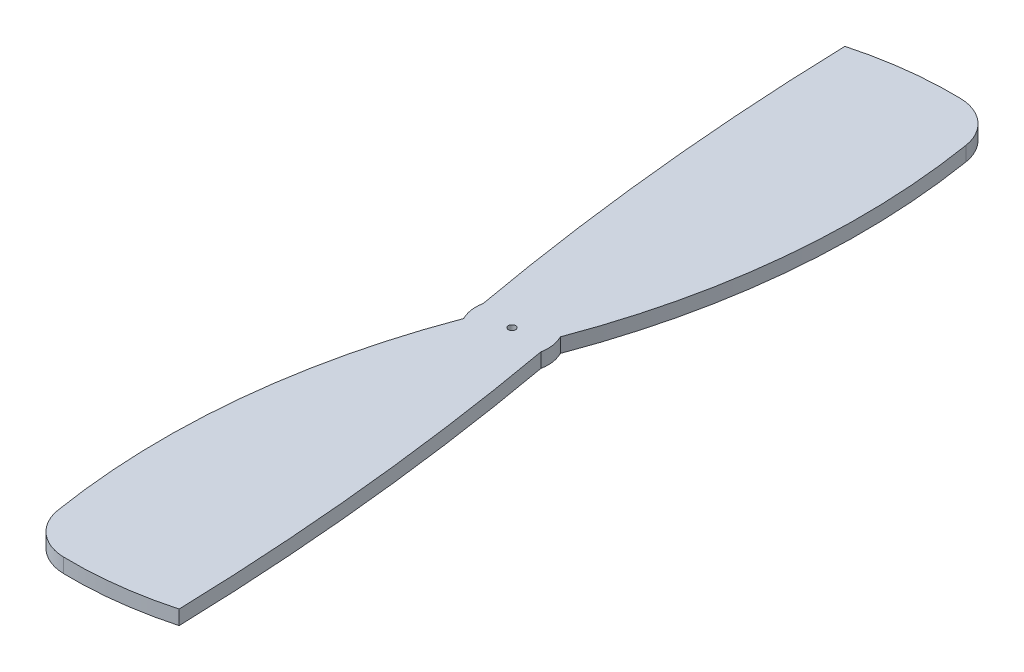
ISO-10303-21;
HEADER;
FILE_DESCRIPTION(('STEP AP214'),'2;1');
FILE_NAME('part.step','',(''),(''),'','','');
FILE_SCHEMA(('AUTOMOTIVE_DESIGN { 1 0 10303 214 1 1 1 1 }'));
ENDSEC;
DATA;
#1=APPLICATION_CONTEXT('core data for automotive mechanical design processes');
#2=APPLICATION_PROTOCOL_DEFINITION('international standard','automotive_design',2000,#1);
#3=PRODUCT_CONTEXT('',#1,'mechanical');
#4=PRODUCT('Part','Part','',(#3));
#5=PRODUCT_RELATED_PRODUCT_CATEGORY('part','',(#4));
#6=PRODUCT_DEFINITION_FORMATION('','',#4);
#7=PRODUCT_DEFINITION_CONTEXT('part definition',#1,'design');
#8=PRODUCT_DEFINITION('design','',#6,#7);
#9=PRODUCT_DEFINITION_SHAPE('','',#8);
#10=(LENGTH_UNIT() NAMED_UNIT(*) SI_UNIT(.MILLI.,.METRE.));
#11=(NAMED_UNIT(*) PLANE_ANGLE_UNIT() SI_UNIT($,.RADIAN.));
#12=(NAMED_UNIT(*) SI_UNIT($,.STERADIAN.) SOLID_ANGLE_UNIT());
#13=UNCERTAINTY_MEASURE_WITH_UNIT(LENGTH_MEASURE(1.E-05),#10,'distance_accuracy_value','');
#14=(GEOMETRIC_REPRESENTATION_CONTEXT(3) GLOBAL_UNCERTAINTY_ASSIGNED_CONTEXT((#13)) GLOBAL_UNIT_ASSIGNED_CONTEXT((#10,
#11,#12)) REPRESENTATION_CONTEXT('',''));
#15=CARTESIAN_POINT('',(0.,0.,0.));
#16=DIRECTION('',(0.,0.,1.));
#17=DIRECTION('',(1.,0.,0.));
#18=AXIS2_PLACEMENT_3D('',#15,#16,#17);
#19=CARTESIAN_POINT('',(-3.16624329817526,0.8,-35.7480702714676));
#20=DIRECTION('',(0.,1.,0.));
#21=DIRECTION('',(0.,0.,1.));
#22=AXIS2_PLACEMENT_3D('',#19,#20,#21);
#23=PLANE('',#22);
#24=CARTESIAN_POINT('',(-2.98248659635051,0.8,-44.4961405429351));
#25=DIRECTION('',(0.,1.,0.));
#26=DIRECTION('',(0.,0.,1.));
#27=AXIS2_PLACEMENT_3D('',#24,#25,#26);
#28=CIRCLE('',#27,2.50000000000001);
#29=CARTESIAN_POINT('',(-0.514652369440545,0.8,-44.8958832457975));
#30=VERTEX_POINT('',#29);
#31=CARTESIAN_POINT('',(-2.92998468154344,0.8,-46.9955891919259));
#32=VERTEX_POINT('',#31);
#33=EDGE_CURVE('E161',#30,#32,#28,.T.);
#34=ORIENTED_EDGE('',*,*,#33,.T.);
#35=CARTESIAN_POINT('',(-3.35,0.8,-27.));
#36=DIRECTION('',(0.,1.,0.));
#37=DIRECTION('',(0.,0.,1.));
#38=AXIS2_PLACEMENT_3D('',#35,#36,#37);
#39=CIRCLE('',#38,20.);
#40=CARTESIAN_POINT('',(-8.64083736312973,0.8,-46.2874840245407));
#41=VERTEX_POINT('',#40);
#42=EDGE_CURVE('E99',#32,#41,#39,.T.);
#43=ORIENTED_EDGE('',*,*,#42,.T.);
#44=CARTESIAN_POINT('',(141.3,0.8,-50.5));
#45=DIRECTION('',(0.,1.,0.));
#46=DIRECTION('',(0.,0.,1.));
#47=AXIS2_PLACEMENT_3D('',#44,#45,#46);
#48=CIRCLE('',#47,150.);
#49=CARTESIAN_POINT('',(-6.31636321069811,0.8,-23.865261171784));
#50=VERTEX_POINT('',#49);
#51=EDGE_CURVE('E182',#41,#50,#48,.T.);
#52=ORIENTED_EDGE('',*,*,#51,.T.);
#53=CARTESIAN_POINT('',(-4.35,0.8,-23.5));
#54=DIRECTION('',(0.,1.,0.));
#55=DIRECTION('',(0.,0.,1.));
#56=AXIS2_PLACEMENT_3D('',#53,#54,#55);
#57=CIRCLE('',#56,2.);
#58=CARTESIAN_POINT('',(-6.13400324761186,0.8,-22.5959356148425));
#59=VERTEX_POINT('',#58);
#60=EDGE_CURVE('E201',#50,#59,#57,.T.);
#61=ORIENTED_EDGE('',*,*,#60,.T.);
#62=CARTESIAN_POINT('',(31.3,0.8,-8.5));
#63=DIRECTION('',(0.,1.,0.));
#64=DIRECTION('',(0.,0.,1.));
#65=AXIS2_PLACEMENT_3D('',#62,#63,#64);
#66=CIRCLE('',#65,40.);
#67=CARTESIAN_POINT('',(-8.18534763055946,0.8,-2.10411675420255));
#68=VERTEX_POINT('',#67);
#69=EDGE_CURVE('E198',#59,#68,#66,.T.);
#70=ORIENTED_EDGE('',*,*,#69,.T.);
#71=CARTESIAN_POINT('',(-5.71751340364949,0.8,-2.50385945706489));
#72=DIRECTION('',(0.,1.,0.));
#73=DIRECTION('',(0.,0.,1.));
#74=AXIS2_PLACEMENT_3D('',#71,#72,#73);
#75=CIRCLE('',#74,2.50000000000001);
#76=CARTESIAN_POINT('',(-5.77001531845657,0.8,-0.00441080807413868));
#77=VERTEX_POINT('',#76);
#78=EDGE_CURVE('E200',#68,#77,#75,.T.);
#79=ORIENTED_EDGE('',*,*,#78,.T.);
#80=CARTESIAN_POINT('',(-5.35,0.8,-20.));
#81=DIRECTION('',(0.,1.,0.));
#82=DIRECTION('',(0.,0.,1.));
#83=AXIS2_PLACEMENT_3D('',#80,#81,#82);
#84=CIRCLE('',#83,20.);
#85=CARTESIAN_POINT('',(-0.0591626368702525,0.8,-0.712515975459353));
#86=VERTEX_POINT('',#85);
#87=EDGE_CURVE('E124',#77,#86,#84,.T.);
#88=ORIENTED_EDGE('',*,*,#87,.T.);
#89=CARTESIAN_POINT('',(-150.,0.8,3.5));
#90=DIRECTION('',(0.,1.,0.));
#91=DIRECTION('',(0.,0.,1.));
#92=AXIS2_PLACEMENT_3D('',#89,#90,#91);
#93=CIRCLE('',#92,150.);
#94=CARTESIAN_POINT('',(-2.38363678930189,0.8,-23.134738828216));
#95=VERTEX_POINT('',#94);
#96=EDGE_CURVE('E118',#86,#95,#93,.T.);
#97=ORIENTED_EDGE('',*,*,#96,.T.);
#98=CARTESIAN_POINT('',(-4.35,0.8,-23.5));
#99=DIRECTION('',(0.,1.,0.));
#100=DIRECTION('',(0.,0.,1.));
#101=AXIS2_PLACEMENT_3D('',#98,#99,#100);
#102=CIRCLE('',#101,2.);
#103=CARTESIAN_POINT('',(-2.56599675238813,0.8,-24.4040643851576));
#104=VERTEX_POINT('',#103);
#105=EDGE_CURVE('E122',#95,#104,#102,.T.);
#106=ORIENTED_EDGE('',*,*,#105,.T.);
#107=CARTESIAN_POINT('',(-40.,0.8,-38.5));
#108=DIRECTION('',(0.,1.,0.));
#109=DIRECTION('',(0.,0.,1.));
#110=AXIS2_PLACEMENT_3D('',#107,#108,#109);
#111=CIRCLE('',#110,40.);
#112=EDGE_CURVE('E50',#104,#30,#111,.T.);
#113=ORIENTED_EDGE('',*,*,#112,.T.);
#114=EDGE_LOOP('',(#34,#43,#52,#61,#70,#79,#88,#97,#106,#113));
#115=FACE_BOUND('',#114,.T.);
#116=CARTESIAN_POINT('',(-4.35,0.8,-23.5));
#117=DIRECTION('',(0.,1.,0.));
#118=DIRECTION('',(0.,0.,1.));
#119=AXIS2_PLACEMENT_3D('',#116,#117,#118);
#120=CIRCLE('',#119,0.199999999999999);
#121=CARTESIAN_POINT('',(-4.35,0.8,-23.3));
#122=VERTEX_POINT('',#121);
#123=EDGE_CURVE('E146',#122,#122,#120,.T.);
#124=ORIENTED_EDGE('',*,*,#123,.F.);
#125=EDGE_LOOP('',(#124));
#126=FACE_BOUND('',#125,.T.);
#127=ADVANCED_FACE('F33',(#115,#126),#23,.T.);
#128=CARTESIAN_POINT('',(-3.16624329817526,0.,-35.7480702714676));
#129=DIRECTION('',(0.,1.,0.));
#130=DIRECTION('',(0.,0.,1.));
#131=AXIS2_PLACEMENT_3D('',#128,#129,#130);
#132=PLANE('',#131);
#133=CARTESIAN_POINT('',(-2.98248659635051,0.,-44.4961405429351));
#134=DIRECTION('',(0.,1.,0.));
#135=DIRECTION('',(0.,0.,1.));
#136=AXIS2_PLACEMENT_3D('',#133,#134,#135);
#137=CIRCLE('',#136,2.50000000000001);
#138=CARTESIAN_POINT('',(-0.514652369440545,0.,-44.8958832457975));
#139=VERTEX_POINT('',#138);
#140=CARTESIAN_POINT('',(-2.92998468154344,0.,-46.9955891919259));
#141=VERTEX_POINT('',#140);
#142=EDGE_CURVE('E142',#139,#141,#137,.T.);
#143=ORIENTED_EDGE('',*,*,#142,.F.);
#144=CARTESIAN_POINT('',(-40.,0.,-38.5));
#145=DIRECTION('',(0.,1.,0.));
#146=DIRECTION('',(0.,0.,1.));
#147=AXIS2_PLACEMENT_3D('',#144,#145,#146);
#148=CIRCLE('',#147,40.);
#149=CARTESIAN_POINT('',(-2.56599675238813,0.,-24.4040643851576));
#150=VERTEX_POINT('',#149);
#151=EDGE_CURVE('E91',#150,#139,#148,.T.);
#152=ORIENTED_EDGE('',*,*,#151,.F.);
#153=CARTESIAN_POINT('',(-4.35,0.,-23.5));
#154=DIRECTION('',(0.,1.,0.));
#155=DIRECTION('',(0.,0.,1.));
#156=AXIS2_PLACEMENT_3D('',#153,#154,#155);
#157=CIRCLE('',#156,2.);
#158=CARTESIAN_POINT('',(-2.38363678930189,0.,-23.134738828216));
#159=VERTEX_POINT('',#158);
#160=EDGE_CURVE('E85',#159,#150,#157,.T.);
#161=ORIENTED_EDGE('',*,*,#160,.F.);
#162=CARTESIAN_POINT('',(-150.,0.,3.5));
#163=DIRECTION('',(0.,1.,0.));
#164=DIRECTION('',(0.,0.,1.));
#165=AXIS2_PLACEMENT_3D('',#162,#163,#164);
#166=CIRCLE('',#165,150.);
#167=CARTESIAN_POINT('',(-0.0591626368702525,0.,-0.712515975459353));
#168=VERTEX_POINT('',#167);
#169=EDGE_CURVE('E132',#168,#159,#166,.T.);
#170=ORIENTED_EDGE('',*,*,#169,.F.);
#171=CARTESIAN_POINT('',(-5.35,0.,-20.));
#172=DIRECTION('',(0.,1.,0.));
#173=DIRECTION('',(0.,0.,1.));
#174=AXIS2_PLACEMENT_3D('',#171,#172,#173);
#175=CIRCLE('',#174,20.);
#176=CARTESIAN_POINT('',(-5.77001531845657,0.,-0.00441080807413868));
#177=VERTEX_POINT('',#176);
#178=EDGE_CURVE('E156',#177,#168,#175,.T.);
#179=ORIENTED_EDGE('',*,*,#178,.F.);
#180=CARTESIAN_POINT('',(-5.71751340364949,0.,-2.50385945706489));
#181=DIRECTION('',(0.,1.,0.));
#182=DIRECTION('',(0.,0.,1.));
#183=AXIS2_PLACEMENT_3D('',#180,#181,#182);
#184=CIRCLE('',#183,2.50000000000001);
#185=CARTESIAN_POINT('',(-8.18534763055946,0.,-2.10411675420255));
#186=VERTEX_POINT('',#185);
#187=EDGE_CURVE('E154',#186,#177,#184,.T.);
#188=ORIENTED_EDGE('',*,*,#187,.F.);
#189=CARTESIAN_POINT('',(31.3,0.,-8.5));
#190=DIRECTION('',(0.,1.,0.));
#191=DIRECTION('',(0.,0.,1.));
#192=AXIS2_PLACEMENT_3D('',#189,#190,#191);
#193=CIRCLE('',#192,40.);
#194=CARTESIAN_POINT('',(-6.13400324761186,0.,-22.5959356148425));
#195=VERTEX_POINT('',#194);
#196=EDGE_CURVE('E152',#195,#186,#193,.T.);
#197=ORIENTED_EDGE('',*,*,#196,.F.);
#198=CARTESIAN_POINT('',(-4.35,0.,-23.5));
#199=DIRECTION('',(0.,1.,0.));
#200=DIRECTION('',(0.,0.,1.));
#201=AXIS2_PLACEMENT_3D('',#198,#199,#200);
#202=CIRCLE('',#201,2.);
#203=CARTESIAN_POINT('',(-6.31636321069811,0.,-23.865261171784));
#204=VERTEX_POINT('',#203);
#205=EDGE_CURVE('E150',#204,#195,#202,.T.);
#206=ORIENTED_EDGE('',*,*,#205,.F.);
#207=CARTESIAN_POINT('',(141.3,0.,-50.5));
#208=DIRECTION('',(0.,1.,0.));
#209=DIRECTION('',(0.,0.,1.));
#210=AXIS2_PLACEMENT_3D('',#207,#208,#209);
#211=CIRCLE('',#210,150.);
#212=CARTESIAN_POINT('',(-8.64083736312973,0.,-46.2874840245407));
#213=VERTEX_POINT('',#212);
#214=EDGE_CURVE('E148',#213,#204,#211,.T.);
#215=ORIENTED_EDGE('',*,*,#214,.F.);
#216=CARTESIAN_POINT('',(-3.35,0.,-27.));
#217=DIRECTION('',(0.,1.,0.));
#218=DIRECTION('',(0.,0.,1.));
#219=AXIS2_PLACEMENT_3D('',#216,#217,#218);
#220=CIRCLE('',#219,20.);
#221=EDGE_CURVE('E145',#141,#213,#220,.T.);
#222=ORIENTED_EDGE('',*,*,#221,.F.);
#223=EDGE_LOOP('',(#143,#152,#161,#170,#179,#188,#197,#206,#215,#222));
#224=FACE_BOUND('',#223,.T.);
#225=CARTESIAN_POINT('',(-4.35,0.,-23.5));
#226=DIRECTION('',(0.,1.,0.));
#227=DIRECTION('',(0.,0.,1.));
#228=AXIS2_PLACEMENT_3D('',#225,#226,#227);
#229=CIRCLE('',#228,0.199999999999999);
#230=CARTESIAN_POINT('',(-4.35,0.,-23.3));
#231=VERTEX_POINT('',#230);
#232=EDGE_CURVE('E209',#231,#231,#229,.T.);
#233=ORIENTED_EDGE('',*,*,#232,.T.);
#234=EDGE_LOOP('',(#233));
#235=FACE_BOUND('',#234,.T.);
#236=ADVANCED_FACE('F186',(#224,#235),#132,.F.);
#237=CARTESIAN_POINT('',(-2.98248659635051,0.8,-44.4961405429351));
#238=DIRECTION('',(0.,-1.,0.));
#239=DIRECTION('',(0.,0.,-1.));
#240=AXIS2_PLACEMENT_3D('',#237,#238,#239);
#241=CYLINDRICAL_SURFACE('',#240,2.50000000000001);
#242=ORIENTED_EDGE('',*,*,#142,.T.);
#243=DIRECTION('',(0.,-1.,0.));
#244=VECTOR('',#243,1.);
#245=CARTESIAN_POINT('',(-2.92998468154344,0.8,-46.9955891919259));
#246=LINE('',#245,#244);
#247=EDGE_CURVE('E11',#32,#141,#246,.T.);
#248=ORIENTED_EDGE('',*,*,#247,.F.);
#249=ORIENTED_EDGE('',*,*,#33,.F.);
#250=DIRECTION('',(0.,-1.,0.));
#251=VECTOR('',#250,1.);
#252=CARTESIAN_POINT('',(-0.514652369440545,0.8,-44.8958832457975));
#253=LINE('',#252,#251);
#254=EDGE_CURVE('E138',#30,#139,#253,.T.);
#255=ORIENTED_EDGE('',*,*,#254,.T.);
#256=EDGE_LOOP('',(#242,#248,#249,#255));
#257=FACE_BOUND('',#256,.T.);
#258=ADVANCED_FACE('F35',(#257),#241,.T.);
#259=CARTESIAN_POINT('',(-3.35,0.8,-27.));
#260=DIRECTION('',(0.,-1.,0.));
#261=DIRECTION('',(0.,0.,-1.));
#262=AXIS2_PLACEMENT_3D('',#259,#260,#261);
#263=CYLINDRICAL_SURFACE('',#262,20.);
#264=ORIENTED_EDGE('',*,*,#221,.T.);
#265=DIRECTION('',(0.,-1.,0.));
#266=VECTOR('',#265,1.);
#267=CARTESIAN_POINT('',(-8.64083736312973,0.8,-46.2874840245407));
#268=LINE('',#267,#266);
#269=EDGE_CURVE('E42',#41,#213,#268,.T.);
#270=ORIENTED_EDGE('',*,*,#269,.F.);
#271=ORIENTED_EDGE('',*,*,#42,.F.);
#272=ORIENTED_EDGE('',*,*,#247,.T.);
#273=EDGE_LOOP('',(#264,#270,#271,#272));
#274=FACE_BOUND('',#273,.T.);
#275=ADVANCED_FACE('F245',(#274),#263,.T.);
#276=CARTESIAN_POINT('',(141.3,0.8,-50.5));
#277=DIRECTION('',(0.,-1.,0.));
#278=DIRECTION('',(0.,0.,-1.));
#279=AXIS2_PLACEMENT_3D('',#276,#277,#278);
#280=CYLINDRICAL_SURFACE('',#279,150.);
#281=ORIENTED_EDGE('',*,*,#214,.T.);
#282=DIRECTION('',(0.,-1.,0.));
#283=VECTOR('',#282,1.);
#284=CARTESIAN_POINT('',(-6.31636321069811,0.8,-23.865261171784));
#285=LINE('',#284,#283);
#286=EDGE_CURVE('E174',#50,#204,#285,.T.);
#287=ORIENTED_EDGE('',*,*,#286,.F.);
#288=ORIENTED_EDGE('',*,*,#51,.F.);
#289=ORIENTED_EDGE('',*,*,#269,.T.);
#290=EDGE_LOOP('',(#281,#287,#288,#289));
#291=FACE_BOUND('',#290,.T.);
#292=ADVANCED_FACE('F180',(#291),#280,.T.);
#293=CARTESIAN_POINT('',(-4.35,0.8,-23.5));
#294=DIRECTION('',(0.,-1.,0.));
#295=DIRECTION('',(0.,0.,-1.));
#296=AXIS2_PLACEMENT_3D('',#293,#294,#295);
#297=CYLINDRICAL_SURFACE('',#296,2.);
#298=ORIENTED_EDGE('',*,*,#205,.T.);
#299=DIRECTION('',(0.,-1.,0.));
#300=VECTOR('',#299,1.);
#301=CARTESIAN_POINT('',(-6.13400324761186,0.8,-22.5959356148425));
#302=LINE('',#301,#300);
#303=EDGE_CURVE('E171',#59,#195,#302,.T.);
#304=ORIENTED_EDGE('',*,*,#303,.F.);
#305=ORIENTED_EDGE('',*,*,#60,.F.);
#306=ORIENTED_EDGE('',*,*,#286,.T.);
#307=EDGE_LOOP('',(#298,#304,#305,#306));
#308=FACE_BOUND('',#307,.T.);
#309=ADVANCED_FACE('F192',(#308),#297,.T.);
#310=CARTESIAN_POINT('',(31.3,0.8,-8.5));
#311=DIRECTION('',(0.,-1.,0.));
#312=DIRECTION('',(0.,0.,-1.));
#313=AXIS2_PLACEMENT_3D('',#310,#311,#312);
#314=CYLINDRICAL_SURFACE('',#313,40.);
#315=ORIENTED_EDGE('',*,*,#196,.T.);
#316=DIRECTION('',(0.,-1.,0.));
#317=VECTOR('',#316,1.);
#318=CARTESIAN_POINT('',(-8.18534763055946,0.8,-2.10411675420255));
#319=LINE('',#318,#317);
#320=EDGE_CURVE('E168',#68,#186,#319,.T.);
#321=ORIENTED_EDGE('',*,*,#320,.F.);
#322=ORIENTED_EDGE('',*,*,#69,.F.);
#323=ORIENTED_EDGE('',*,*,#303,.T.);
#324=EDGE_LOOP('',(#315,#321,#322,#323));
#325=FACE_BOUND('',#324,.T.);
#326=ADVANCED_FACE('F196',(#325),#314,.T.);
#327=CARTESIAN_POINT('',(-5.71751340364949,0.8,-2.50385945706489));
#328=DIRECTION('',(0.,-1.,0.));
#329=DIRECTION('',(0.,0.,-1.));
#330=AXIS2_PLACEMENT_3D('',#327,#328,#329);
#331=CYLINDRICAL_SURFACE('',#330,2.50000000000001);
#332=ORIENTED_EDGE('',*,*,#187,.T.);
#333=DIRECTION('',(0.,-1.,0.));
#334=VECTOR('',#333,1.);
#335=CARTESIAN_POINT('',(-5.77001531845657,0.8,-0.00441080807413868));
#336=LINE('',#335,#334);
#337=EDGE_CURVE('E165',#77,#177,#336,.T.);
#338=ORIENTED_EDGE('',*,*,#337,.F.);
#339=ORIENTED_EDGE('',*,*,#78,.F.);
#340=ORIENTED_EDGE('',*,*,#320,.T.);
#341=EDGE_LOOP('',(#332,#338,#339,#340));
#342=FACE_BOUND('',#341,.T.);
#343=ADVANCED_FACE('F235',(#342),#331,.T.);
#344=CARTESIAN_POINT('',(-5.35,0.8,-20.));
#345=DIRECTION('',(0.,-1.,0.));
#346=DIRECTION('',(0.,0.,-1.));
#347=AXIS2_PLACEMENT_3D('',#344,#345,#346);
#348=CYLINDRICAL_SURFACE('',#347,20.);
#349=ORIENTED_EDGE('',*,*,#178,.T.);
#350=DIRECTION('',(0.,-1.,0.));
#351=VECTOR('',#350,1.);
#352=CARTESIAN_POINT('',(-0.0591626368702525,0.8,-0.712515975459353));
#353=LINE('',#352,#351);
#354=EDGE_CURVE('E133',#86,#168,#353,.T.);
#355=ORIENTED_EDGE('',*,*,#354,.F.);
#356=ORIENTED_EDGE('',*,*,#87,.F.);
#357=ORIENTED_EDGE('',*,*,#337,.T.);
#358=EDGE_LOOP('',(#349,#355,#356,#357));
#359=FACE_BOUND('',#358,.T.);
#360=ADVANCED_FACE('F232',(#359),#348,.T.);
#361=CARTESIAN_POINT('',(-150.,0.8,3.5));
#362=DIRECTION('',(0.,-1.,0.));
#363=DIRECTION('',(0.,0.,-1.));
#364=AXIS2_PLACEMENT_3D('',#361,#362,#363);
#365=CYLINDRICAL_SURFACE('',#364,150.);
#366=ORIENTED_EDGE('',*,*,#169,.T.);
#367=DIRECTION('',(0.,-1.,0.));
#368=VECTOR('',#367,1.);
#369=CARTESIAN_POINT('',(-2.38363678930189,0.8,-23.134738828216));
#370=LINE('',#369,#368);
#371=EDGE_CURVE('E129',#95,#159,#370,.T.);
#372=ORIENTED_EDGE('',*,*,#371,.F.);
#373=ORIENTED_EDGE('',*,*,#96,.F.);
#374=ORIENTED_EDGE('',*,*,#354,.T.);
#375=EDGE_LOOP('',(#366,#372,#373,#374));
#376=FACE_BOUND('',#375,.T.);
#377=ADVANCED_FACE('F130',(#376),#365,.T.);
#378=CARTESIAN_POINT('',(-4.35,0.8,-23.5));
#379=DIRECTION('',(0.,-1.,0.));
#380=DIRECTION('',(0.,0.,-1.));
#381=AXIS2_PLACEMENT_3D('',#378,#379,#380);
#382=CYLINDRICAL_SURFACE('',#381,2.);
#383=ORIENTED_EDGE('',*,*,#160,.T.);
#384=DIRECTION('',(0.,-1.,0.));
#385=VECTOR('',#384,1.);
#386=CARTESIAN_POINT('',(-2.56599675238813,0.8,-24.4040643851576));
#387=LINE('',#386,#385);
#388=EDGE_CURVE('E134',#104,#150,#387,.T.);
#389=ORIENTED_EDGE('',*,*,#388,.F.);
#390=ORIENTED_EDGE('',*,*,#105,.F.);
#391=ORIENTED_EDGE('',*,*,#371,.T.);
#392=EDGE_LOOP('',(#383,#389,#390,#391));
#393=FACE_BOUND('',#392,.T.);
#394=ADVANCED_FACE('F136',(#393),#382,.T.);
#395=CARTESIAN_POINT('',(-40.,0.8,-38.5));
#396=DIRECTION('',(0.,-1.,0.));
#397=DIRECTION('',(0.,0.,-1.));
#398=AXIS2_PLACEMENT_3D('',#395,#396,#397);
#399=CYLINDRICAL_SURFACE('',#398,40.);
#400=ORIENTED_EDGE('',*,*,#151,.T.);
#401=ORIENTED_EDGE('',*,*,#254,.F.);
#402=ORIENTED_EDGE('',*,*,#112,.F.);
#403=ORIENTED_EDGE('',*,*,#388,.T.);
#404=EDGE_LOOP('',(#400,#401,#402,#403));
#405=FACE_BOUND('',#404,.T.);
#406=ADVANCED_FACE('F225',(#405),#399,.T.);
#407=CARTESIAN_POINT('',(-4.35,0.8,-23.5));
#408=DIRECTION('',(0.,-1.,0.));
#409=DIRECTION('',(0.,0.,-1.));
#410=AXIS2_PLACEMENT_3D('',#407,#408,#409);
#411=CYLINDRICAL_SURFACE('',#410,0.199999999999999);
#412=ORIENTED_EDGE('',*,*,#123,.T.);
#413=EDGE_LOOP('',(#412));
#414=FACE_BOUND('',#413,.T.);
#415=ORIENTED_EDGE('',*,*,#232,.F.);
#416=EDGE_LOOP('',(#415));
#417=FACE_BOUND('',#416,.T.);
#418=ADVANCED_FACE('F215',(#414,#417),#411,.F.);
#419=CLOSED_SHELL('',(#127,#236,#258,#275,#292,#309,#326,#343,#360,#377,#394,#406,#418));
#420=MANIFOLD_SOLID_BREP('B2',#419);
#421=ADVANCED_BREP_SHAPE_REPRESENTATION('',(#18,#420),#14);
#422=SHAPE_DEFINITION_REPRESENTATION(#9,#421);
ENDSEC;
END-ISO-10303-21;
